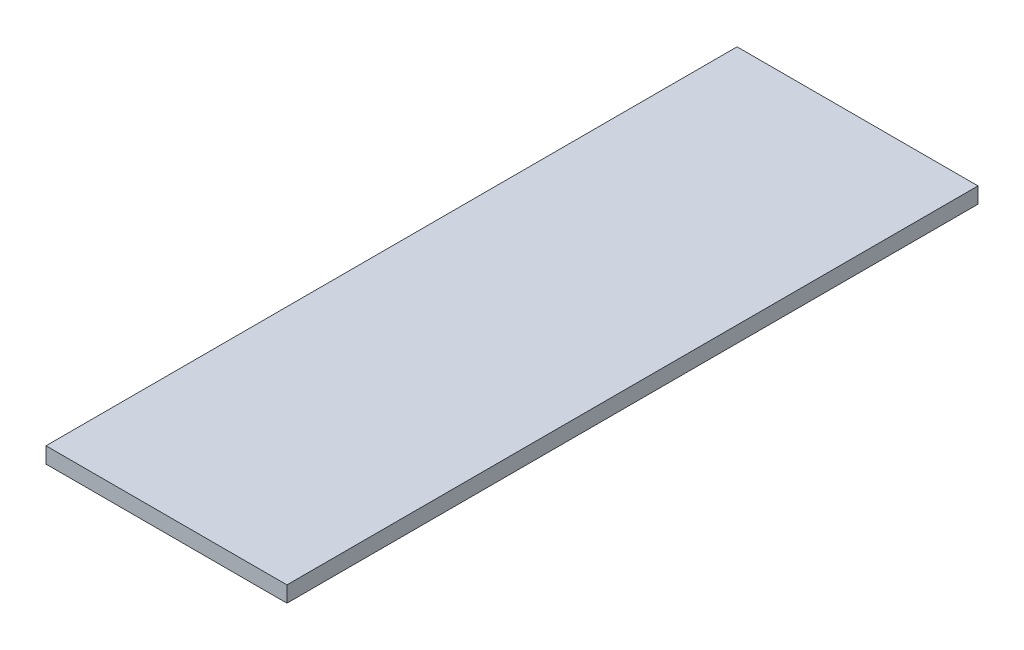
ISO-10303-21;
HEADER;
FILE_DESCRIPTION(('STEP AP214'),'2;1');
FILE_NAME('part.step','',(''),(''),'','','');
FILE_SCHEMA(('AUTOMOTIVE_DESIGN { 1 0 10303 214 1 1 1 1 }'));
ENDSEC;
DATA;
#1=APPLICATION_CONTEXT('core data for automotive mechanical design processes');
#2=APPLICATION_PROTOCOL_DEFINITION('international standard','automotive_design',2000,#1);
#3=PRODUCT_CONTEXT('',#1,'mechanical');
#4=PRODUCT('Part','Part','',(#3));
#5=PRODUCT_RELATED_PRODUCT_CATEGORY('part','',(#4));
#6=PRODUCT_DEFINITION_FORMATION('','',#4);
#7=PRODUCT_DEFINITION_CONTEXT('part definition',#1,'design');
#8=PRODUCT_DEFINITION('design','',#6,#7);
#9=PRODUCT_DEFINITION_SHAPE('','',#8);
#10=(LENGTH_UNIT() NAMED_UNIT(*) SI_UNIT(.MILLI.,.METRE.));
#11=(NAMED_UNIT(*) PLANE_ANGLE_UNIT() SI_UNIT($,.RADIAN.));
#12=(NAMED_UNIT(*) SI_UNIT($,.STERADIAN.) SOLID_ANGLE_UNIT());
#13=UNCERTAINTY_MEASURE_WITH_UNIT(LENGTH_MEASURE(1.E-05),#10,'distance_accuracy_value','');
#14=(GEOMETRIC_REPRESENTATION_CONTEXT(3) GLOBAL_UNCERTAINTY_ASSIGNED_CONTEXT((#13)) GLOBAL_UNIT_ASSIGNED_CONTEXT((#10,
#11,#12)) REPRESENTATION_CONTEXT('',''));
#15=CARTESIAN_POINT('',(0.,0.,0.));
#16=DIRECTION('',(0.,0.,1.));
#17=DIRECTION('',(1.,0.,0.));
#18=AXIS2_PLACEMENT_3D('',#15,#16,#17);
#19=CARTESIAN_POINT('',(24.0875,3.175,69.0875));
#20=DIRECTION('',(-1.,0.,0.));
#21=DIRECTION('',(0.,0.,1.));
#22=AXIS2_PLACEMENT_3D('',#19,#20,#21);
#23=PLANE('',#22);
#24=DIRECTION('',(0.,0.,-1.));
#25=VECTOR('',#24,1.);
#26=CARTESIAN_POINT('',(24.0875,0.,69.0875));
#27=LINE('',#26,#25);
#28=CARTESIAN_POINT('',(24.0875,0.,69.0875));
#29=VERTEX_POINT('',#28);
#30=CARTESIAN_POINT('',(24.0875,0.,-69.0875));
#31=VERTEX_POINT('',#30);
#32=EDGE_CURVE('E98',#29,#31,#27,.T.);
#33=ORIENTED_EDGE('',*,*,#32,.T.);
#34=DIRECTION('',(0.,-1.,0.));
#35=VECTOR('',#34,1.);
#36=CARTESIAN_POINT('',(24.0875,3.175,-69.0875));
#37=LINE('',#36,#35);
#38=CARTESIAN_POINT('',(24.0875,3.175,-69.0875));
#39=VERTEX_POINT('',#38);
#40=EDGE_CURVE('E11',#39,#31,#37,.T.);
#41=ORIENTED_EDGE('',*,*,#40,.F.);
#42=DIRECTION('',(0.,0.,-1.));
#43=VECTOR('',#42,1.);
#44=CARTESIAN_POINT('',(24.0875,3.175,69.0875));
#45=LINE('',#44,#43);
#46=CARTESIAN_POINT('',(24.0875,3.175,69.0875));
#47=VERTEX_POINT('',#46);
#48=EDGE_CURVE('E86',#47,#39,#45,.T.);
#49=ORIENTED_EDGE('',*,*,#48,.F.);
#50=DIRECTION('',(0.,-1.,0.));
#51=VECTOR('',#50,1.);
#52=CARTESIAN_POINT('',(24.0875,3.175,69.0875));
#53=LINE('',#52,#51);
#54=EDGE_CURVE('E94',#47,#29,#53,.T.);
#55=ORIENTED_EDGE('',*,*,#54,.T.);
#56=EDGE_LOOP('',(#33,#41,#49,#55));
#57=FACE_BOUND('',#56,.T.);
#58=ADVANCED_FACE('F35',(#57),#23,.F.);
#59=CARTESIAN_POINT('',(-24.0875,3.175,-69.0875));
#60=DIRECTION('',(0.,0.,1.));
#61=DIRECTION('',(1.,0.,0.));
#62=AXIS2_PLACEMENT_3D('',#59,#60,#61);
#63=PLANE('',#62);
#64=DIRECTION('',(-1.,0.,0.));
#65=VECTOR('',#64,1.);
#66=CARTESIAN_POINT('',(-24.0875,0.,-69.0875));
#67=LINE('',#66,#65);
#68=CARTESIAN_POINT('',(-24.0875,0.,-69.0875));
#69=VERTEX_POINT('',#68);
#70=EDGE_CURVE('E90',#31,#69,#67,.T.);
#71=ORIENTED_EDGE('',*,*,#70,.T.);
#72=DIRECTION('',(0.,-1.,0.));
#73=VECTOR('',#72,1.);
#74=CARTESIAN_POINT('',(-24.0875,3.175,-69.0875));
#75=LINE('',#74,#73);
#76=CARTESIAN_POINT('',(-24.0875,3.175,-69.0875));
#77=VERTEX_POINT('',#76);
#78=EDGE_CURVE('E43',#77,#69,#75,.T.);
#79=ORIENTED_EDGE('',*,*,#78,.F.);
#80=DIRECTION('',(-1.,0.,0.));
#81=VECTOR('',#80,1.);
#82=CARTESIAN_POINT('',(-24.0875,3.175,-69.0875));
#83=LINE('',#82,#81);
#84=EDGE_CURVE('E81',#39,#77,#83,.T.);
#85=ORIENTED_EDGE('',*,*,#84,.F.);
#86=ORIENTED_EDGE('',*,*,#40,.T.);
#87=EDGE_LOOP('',(#71,#79,#85,#86));
#88=FACE_BOUND('',#87,.T.);
#89=ADVANCED_FACE('F89',(#88),#63,.F.);
#90=CARTESIAN_POINT('',(-24.0875,3.175,69.0875));
#91=DIRECTION('',(1.,0.,0.));
#92=DIRECTION('',(0.,0.,-1.));
#93=AXIS2_PLACEMENT_3D('',#90,#91,#92);
#94=PLANE('',#93);
#95=DIRECTION('',(0.,0.,1.));
#96=VECTOR('',#95,1.);
#97=CARTESIAN_POINT('',(-24.0875,0.,69.0875));
#98=LINE('',#97,#96);
#99=CARTESIAN_POINT('',(-24.0875,0.,69.0875));
#100=VERTEX_POINT('',#99);
#101=EDGE_CURVE('E68',#69,#100,#98,.T.);
#102=ORIENTED_EDGE('',*,*,#101,.T.);
#103=DIRECTION('',(0.,-1.,0.));
#104=VECTOR('',#103,1.);
#105=CARTESIAN_POINT('',(-24.0875,3.175,69.0875));
#106=LINE('',#105,#104);
#107=CARTESIAN_POINT('',(-24.0875,3.175,69.0875));
#108=VERTEX_POINT('',#107);
#109=EDGE_CURVE('E91',#108,#100,#106,.T.);
#110=ORIENTED_EDGE('',*,*,#109,.F.);
#111=DIRECTION('',(0.,0.,1.));
#112=VECTOR('',#111,1.);
#113=CARTESIAN_POINT('',(-24.0875,3.175,69.0875));
#114=LINE('',#113,#112);
#115=EDGE_CURVE('E84',#77,#108,#114,.T.);
#116=ORIENTED_EDGE('',*,*,#115,.F.);
#117=ORIENTED_EDGE('',*,*,#78,.T.);
#118=EDGE_LOOP('',(#102,#110,#116,#117));
#119=FACE_BOUND('',#118,.T.);
#120=ADVANCED_FACE('F92',(#119),#94,.F.);
#121=CARTESIAN_POINT('',(-24.0875,3.175,69.0875));
#122=DIRECTION('',(0.,0.,-1.));
#123=DIRECTION('',(-1.,0.,0.));
#124=AXIS2_PLACEMENT_3D('',#121,#122,#123);
#125=PLANE('',#124);
#126=DIRECTION('',(1.,0.,0.));
#127=VECTOR('',#126,1.);
#128=CARTESIAN_POINT('',(-24.0875,0.,69.0875));
#129=LINE('',#128,#127);
#130=EDGE_CURVE('E74',#100,#29,#129,.T.);
#131=ORIENTED_EDGE('',*,*,#130,.T.);
#132=ORIENTED_EDGE('',*,*,#54,.F.);
#133=DIRECTION('',(1.,0.,0.));
#134=VECTOR('',#133,1.);
#135=CARTESIAN_POINT('',(-24.0875,3.175,69.0875));
#136=LINE('',#135,#134);
#137=EDGE_CURVE('E51',#108,#47,#136,.T.);
#138=ORIENTED_EDGE('',*,*,#137,.F.);
#139=ORIENTED_EDGE('',*,*,#109,.T.);
#140=EDGE_LOOP('',(#131,#132,#138,#139));
#141=FACE_BOUND('',#140,.T.);
#142=ADVANCED_FACE('F105',(#141),#125,.F.);
#143=CARTESIAN_POINT('',(0.,3.175,0.));
#144=DIRECTION('',(0.,-1.,0.));
#145=DIRECTION('',(0.,0.,-1.));
#146=AXIS2_PLACEMENT_3D('',#143,#144,#145);
#147=PLANE('',#146);
#148=ORIENTED_EDGE('',*,*,#48,.T.);
#149=ORIENTED_EDGE('',*,*,#84,.T.);
#150=ORIENTED_EDGE('',*,*,#115,.T.);
#151=ORIENTED_EDGE('',*,*,#137,.T.);
#152=EDGE_LOOP('',(#148,#149,#150,#151));
#153=FACE_BOUND('',#152,.T.);
#154=ADVANCED_FACE('F82',(#153),#147,.F.);
#155=CARTESIAN_POINT('',(0.,0.,0.));
#156=DIRECTION('',(0.,-1.,0.));
#157=DIRECTION('',(0.,0.,-1.));
#158=AXIS2_PLACEMENT_3D('',#155,#156,#157);
#159=PLANE('',#158);
#160=ORIENTED_EDGE('',*,*,#32,.F.);
#161=ORIENTED_EDGE('',*,*,#130,.F.);
#162=ORIENTED_EDGE('',*,*,#101,.F.);
#163=ORIENTED_EDGE('',*,*,#70,.F.);
#164=EDGE_LOOP('',(#160,#161,#162,#163));
#165=FACE_BOUND('',#164,.T.);
#166=ADVANCED_FACE('F108',(#165),#159,.T.);
#167=CLOSED_SHELL('',(#58,#89,#120,#142,#154,#166));
#168=MANIFOLD_SOLID_BREP('B2',#167);
#169=ADVANCED_BREP_SHAPE_REPRESENTATION('',(#18,#168),#14);
#170=SHAPE_DEFINITION_REPRESENTATION(#9,#169);
ENDSEC;
END-ISO-10303-21;
